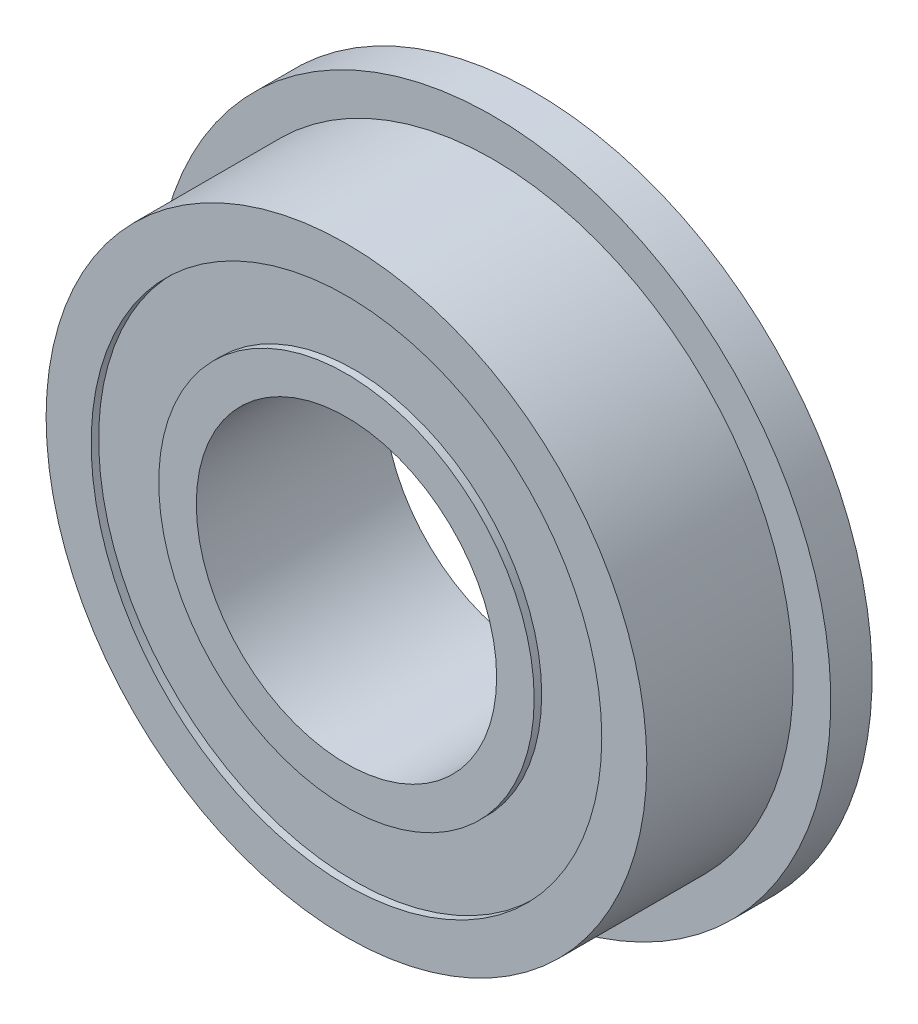
ISO-10303-21;
HEADER;
FILE_DESCRIPTION(('STEP AP214'),'2;1');
FILE_NAME('part.step','',(''),(''),'','','');
FILE_SCHEMA(('AUTOMOTIVE_DESIGN { 1 0 10303 214 1 1 1 1 }'));
ENDSEC;
DATA;
#1=APPLICATION_CONTEXT('core data for automotive mechanical design processes');
#2=APPLICATION_PROTOCOL_DEFINITION('international standard','automotive_design',2000,#1);
#3=PRODUCT_CONTEXT('',#1,'mechanical');
#4=PRODUCT('Part','Part','',(#3));
#5=PRODUCT_RELATED_PRODUCT_CATEGORY('part','',(#4));
#6=PRODUCT_DEFINITION_FORMATION('','',#4);
#7=PRODUCT_DEFINITION_CONTEXT('part definition',#1,'design');
#8=PRODUCT_DEFINITION('design','',#6,#7);
#9=PRODUCT_DEFINITION_SHAPE('','',#8);
#10=(LENGTH_UNIT() NAMED_UNIT(*) SI_UNIT(.MILLI.,.METRE.));
#11=(NAMED_UNIT(*) PLANE_ANGLE_UNIT() SI_UNIT($,.RADIAN.));
#12=(NAMED_UNIT(*) SI_UNIT($,.STERADIAN.) SOLID_ANGLE_UNIT());
#13=UNCERTAINTY_MEASURE_WITH_UNIT(LENGTH_MEASURE(1.E-05),#10,'distance_accuracy_value','');
#14=(GEOMETRIC_REPRESENTATION_CONTEXT(3) GLOBAL_UNCERTAINTY_ASSIGNED_CONTEXT((#13)) GLOBAL_UNIT_ASSIGNED_CONTEXT((#10,
#11,#12)) REPRESENTATION_CONTEXT('',''));
#15=CARTESIAN_POINT('',(0.,0.,0.));
#16=DIRECTION('',(0.,0.,1.));
#17=DIRECTION('',(1.,0.,0.));
#18=AXIS2_PLACEMENT_3D('',#15,#16,#17);
#19=CARTESIAN_POINT('',(0.,0.,-2.5));
#20=DIRECTION('',(0.,0.,1.));
#21=DIRECTION('',(1.,0.,0.));
#22=AXIS2_PLACEMENT_3D('',#19,#20,#21);
#23=PLANE('',#22);
#24=CARTESIAN_POINT('',(0.,0.,-2.5));
#25=DIRECTION('',(0.,0.,1.));
#26=DIRECTION('',(1.,0.,0.));
#27=AXIS2_PLACEMENT_3D('',#24,#25,#26);
#28=CIRCLE('',#27,4.);
#29=CARTESIAN_POINT('',(4.,0.,-2.5));
#30=VERTEX_POINT('',#29);
#31=EDGE_CURVE('E52',#30,#30,#28,.T.);
#32=ORIENTED_EDGE('',*,*,#31,.T.);
#33=EDGE_LOOP('',(#32));
#34=FACE_BOUND('',#33,.T.);
#35=CARTESIAN_POINT('',(0.,0.,-2.5));
#36=DIRECTION('',(0.,0.,1.));
#37=DIRECTION('',(1.,0.,0.));
#38=AXIS2_PLACEMENT_3D('',#35,#36,#37);
#39=CIRCLE('',#38,5.);
#40=CARTESIAN_POINT('',(5.,0.,-2.5));
#41=VERTEX_POINT('',#40);
#42=EDGE_CURVE('E78',#41,#41,#39,.T.);
#43=ORIENTED_EDGE('',*,*,#42,.F.);
#44=EDGE_LOOP('',(#43));
#45=FACE_BOUND('',#44,.T.);
#46=ADVANCED_FACE('F33',(#34,#45),#23,.F.);
#47=CARTESIAN_POINT('',(0.,0.,2.5));
#48=DIRECTION('',(0.,0.,1.));
#49=DIRECTION('',(1.,0.,0.));
#50=AXIS2_PLACEMENT_3D('',#47,#48,#49);
#51=PLANE('',#50);
#52=CARTESIAN_POINT('',(0.,0.,2.5));
#53=DIRECTION('',(0.,0.,1.));
#54=DIRECTION('',(1.,0.,0.));
#55=AXIS2_PLACEMENT_3D('',#52,#53,#54);
#56=CIRCLE('',#55,4.);
#57=CARTESIAN_POINT('',(4.,0.,2.5));
#58=VERTEX_POINT('',#57);
#59=EDGE_CURVE('E54',#58,#58,#56,.T.);
#60=ORIENTED_EDGE('',*,*,#59,.F.);
#61=EDGE_LOOP('',(#60));
#62=FACE_BOUND('',#61,.T.);
#63=CARTESIAN_POINT('',(0.,0.,2.5));
#64=DIRECTION('',(0.,0.,1.));
#65=DIRECTION('',(1.,0.,0.));
#66=AXIS2_PLACEMENT_3D('',#63,#64,#65);
#67=CIRCLE('',#66,5.);
#68=CARTESIAN_POINT('',(5.,0.,2.5));
#69=VERTEX_POINT('',#68);
#70=EDGE_CURVE('E66',#69,#69,#67,.T.);
#71=ORIENTED_EDGE('',*,*,#70,.T.);
#72=EDGE_LOOP('',(#71));
#73=FACE_BOUND('',#72,.T.);
#74=ADVANCED_FACE('F94',(#62,#73),#51,.T.);
#75=CARTESIAN_POINT('',(0.,0.,2.5));
#76=DIRECTION('',(0.,0.,-1.));
#77=DIRECTION('',(-1.,0.,0.));
#78=AXIS2_PLACEMENT_3D('',#75,#76,#77);
#79=CYLINDRICAL_SURFACE('',#78,8.);
#80=CARTESIAN_POINT('',(0.,0.,2.5));
#81=DIRECTION('',(0.,0.,1.));
#82=DIRECTION('',(1.,0.,0.));
#83=AXIS2_PLACEMENT_3D('',#80,#81,#82);
#84=CIRCLE('',#83,8.);
#85=CARTESIAN_POINT('',(8.,0.,2.5));
#86=VERTEX_POINT('',#85);
#87=EDGE_CURVE('E40',#86,#86,#84,.T.);
#88=ORIENTED_EDGE('',*,*,#87,.F.);
#89=EDGE_LOOP('',(#88));
#90=FACE_BOUND('',#89,.T.);
#91=CARTESIAN_POINT('',(0.,0.,-1.4));
#92=DIRECTION('',(0.,0.,-1.));
#93=DIRECTION('',(-1.,0.,0.));
#94=AXIS2_PLACEMENT_3D('',#91,#92,#93);
#95=CIRCLE('',#94,8.);
#96=CARTESIAN_POINT('',(-8.,0.,-1.4));
#97=VERTEX_POINT('',#96);
#98=EDGE_CURVE('E10',#97,#97,#95,.T.);
#99=ORIENTED_EDGE('',*,*,#98,.F.);
#100=EDGE_LOOP('',(#99));
#101=FACE_BOUND('',#100,.T.);
#102=ADVANCED_FACE('F35',(#90,#101),#79,.T.);
#103=CARTESIAN_POINT('',(0.,0.,2.5));
#104=DIRECTION('',(0.,0.,1.));
#105=DIRECTION('',(1.,0.,0.));
#106=AXIS2_PLACEMENT_3D('',#103,#104,#105);
#107=CIRCLE('',#106,6.8);
#108=CARTESIAN_POINT('',(6.8,0.,2.5));
#109=VERTEX_POINT('',#108);
#110=EDGE_CURVE('E60',#109,#109,#107,.T.);
#111=ORIENTED_EDGE('',*,*,#110,.F.);
#112=EDGE_LOOP('',(#111));
#113=FACE_BOUND('',#112,.T.);
#114=ORIENTED_EDGE('',*,*,#87,.T.);
#115=EDGE_LOOP('',(#114));
#116=FACE_BOUND('',#115,.T.);
#117=ADVANCED_FACE('F102',(#113,#116),#51,.T.);
#118=CARTESIAN_POINT('',(0.,0.,-1.4));
#119=DIRECTION('',(0.,0.,-1.));
#120=DIRECTION('',(-1.,0.,0.));
#121=AXIS2_PLACEMENT_3D('',#118,#119,#120);
#122=CYLINDRICAL_SURFACE('',#121,9.);
#123=CARTESIAN_POINT('',(0.,0.,-1.4));
#124=DIRECTION('',(0.,0.,-1.));
#125=DIRECTION('',(-1.,0.,0.));
#126=AXIS2_PLACEMENT_3D('',#123,#124,#125);
#127=CIRCLE('',#126,9.);
#128=CARTESIAN_POINT('',(-9.,0.,-1.4));
#129=VERTEX_POINT('',#128);
#130=EDGE_CURVE('E44',#129,#129,#127,.T.);
#131=ORIENTED_EDGE('',*,*,#130,.T.);
#132=EDGE_LOOP('',(#131));
#133=FACE_BOUND('',#132,.T.);
#134=CARTESIAN_POINT('',(0.,0.,-2.5));
#135=DIRECTION('',(0.,0.,-1.));
#136=DIRECTION('',(-1.,0.,0.));
#137=AXIS2_PLACEMENT_3D('',#134,#135,#136);
#138=CIRCLE('',#137,9.);
#139=CARTESIAN_POINT('',(-9.,0.,-2.5));
#140=VERTEX_POINT('',#139);
#141=EDGE_CURVE('E48',#140,#140,#138,.T.);
#142=ORIENTED_EDGE('',*,*,#141,.F.);
#143=EDGE_LOOP('',(#142));
#144=FACE_BOUND('',#143,.T.);
#145=ADVANCED_FACE('F114',(#133,#144),#122,.T.);
#146=CARTESIAN_POINT('',(0.,0.,-1.4));
#147=DIRECTION('',(0.,0.,-1.));
#148=DIRECTION('',(-1.,0.,0.));
#149=AXIS2_PLACEMENT_3D('',#146,#147,#148);
#150=PLANE('',#149);
#151=ORIENTED_EDGE('',*,*,#98,.T.);
#152=EDGE_LOOP('',(#151));
#153=FACE_BOUND('',#152,.T.);
#154=ORIENTED_EDGE('',*,*,#130,.F.);
#155=EDGE_LOOP('',(#154));
#156=FACE_BOUND('',#155,.T.);
#157=ADVANCED_FACE('F105',(#153,#156),#150,.F.);
#158=CARTESIAN_POINT('',(0.,0.,-2.5));
#159=DIRECTION('',(0.,0.,1.));
#160=DIRECTION('',(1.,0.,0.));
#161=AXIS2_PLACEMENT_3D('',#158,#159,#160);
#162=CIRCLE('',#161,6.8);
#163=CARTESIAN_POINT('',(6.8,0.,-2.5));
#164=VERTEX_POINT('',#163);
#165=EDGE_CURVE('E72',#164,#164,#162,.T.);
#166=ORIENTED_EDGE('',*,*,#165,.T.);
#167=EDGE_LOOP('',(#166));
#168=FACE_BOUND('',#167,.T.);
#169=ORIENTED_EDGE('',*,*,#141,.T.);
#170=EDGE_LOOP('',(#169));
#171=FACE_BOUND('',#170,.T.);
#172=ADVANCED_FACE('F96',(#168,#171),#23,.F.);
#173=CARTESIAN_POINT('',(0.,0.,-2.5));
#174=DIRECTION('',(0.,0.,1.));
#175=DIRECTION('',(1.,0.,0.));
#176=AXIS2_PLACEMENT_3D('',#173,#174,#175);
#177=CYLINDRICAL_SURFACE('',#176,4.);
#178=ORIENTED_EDGE('',*,*,#31,.F.);
#179=EDGE_LOOP('',(#178));
#180=FACE_BOUND('',#179,.T.);
#181=ORIENTED_EDGE('',*,*,#59,.T.);
#182=EDGE_LOOP('',(#181));
#183=FACE_BOUND('',#182,.T.);
#184=ADVANCED_FACE('F104',(#180,#183),#177,.F.);
#185=CARTESIAN_POINT('',(0.,0.,2.3));
#186=DIRECTION('',(0.,0.,1.));
#187=DIRECTION('',(1.,0.,0.));
#188=AXIS2_PLACEMENT_3D('',#185,#186,#187);
#189=CYLINDRICAL_SURFACE('',#188,6.8);
#190=CARTESIAN_POINT('',(0.,0.,2.3));
#191=DIRECTION('',(0.,0.,1.));
#192=DIRECTION('',(1.,0.,0.));
#193=AXIS2_PLACEMENT_3D('',#190,#191,#192);
#194=CIRCLE('',#193,6.8);
#195=CARTESIAN_POINT('',(6.8,0.,2.3));
#196=VERTEX_POINT('',#195);
#197=EDGE_CURVE('E57',#196,#196,#194,.T.);
#198=ORIENTED_EDGE('',*,*,#197,.F.);
#199=EDGE_LOOP('',(#198));
#200=FACE_BOUND('',#199,.T.);
#201=ORIENTED_EDGE('',*,*,#110,.T.);
#202=EDGE_LOOP('',(#201));
#203=FACE_BOUND('',#202,.T.);
#204=ADVANCED_FACE('F111',(#200,#203),#189,.F.);
#205=CARTESIAN_POINT('',(0.,0.,2.3));
#206=DIRECTION('',(0.,0.,1.));
#207=DIRECTION('',(1.,0.,0.));
#208=AXIS2_PLACEMENT_3D('',#205,#206,#207);
#209=PLANE('',#208);
#210=CARTESIAN_POINT('',(0.,0.,2.3));
#211=DIRECTION('',(0.,0.,1.));
#212=DIRECTION('',(1.,0.,0.));
#213=AXIS2_PLACEMENT_3D('',#210,#211,#212);
#214=CIRCLE('',#213,5.);
#215=CARTESIAN_POINT('',(5.,0.,2.3));
#216=VERTEX_POINT('',#215);
#217=EDGE_CURVE('E63',#216,#216,#214,.T.);
#218=ORIENTED_EDGE('',*,*,#217,.F.);
#219=EDGE_LOOP('',(#218));
#220=FACE_BOUND('',#219,.T.);
#221=ORIENTED_EDGE('',*,*,#197,.T.);
#222=EDGE_LOOP('',(#221));
#223=FACE_BOUND('',#222,.T.);
#224=ADVANCED_FACE('F130',(#220,#223),#209,.T.);
#225=CARTESIAN_POINT('',(0.,0.,2.3));
#226=DIRECTION('',(0.,0.,1.));
#227=DIRECTION('',(1.,0.,0.));
#228=AXIS2_PLACEMENT_3D('',#225,#226,#227);
#229=CYLINDRICAL_SURFACE('',#228,5.);
#230=ORIENTED_EDGE('',*,*,#217,.T.);
#231=EDGE_LOOP('',(#230));
#232=FACE_BOUND('',#231,.T.);
#233=ORIENTED_EDGE('',*,*,#70,.F.);
#234=EDGE_LOOP('',(#233));
#235=FACE_BOUND('',#234,.T.);
#236=ADVANCED_FACE('F134',(#232,#235),#229,.T.);
#237=CARTESIAN_POINT('',(0.,0.,-2.3));
#238=DIRECTION('',(0.,0.,-1.));
#239=DIRECTION('',(1.,0.,0.));
#240=AXIS2_PLACEMENT_3D('',#237,#238,#239);
#241=PLANE('',#240);
#242=CARTESIAN_POINT('',(0.,0.,-2.3));
#243=DIRECTION('',(0.,0.,1.));
#244=DIRECTION('',(1.,0.,0.));
#245=AXIS2_PLACEMENT_3D('',#242,#243,#244);
#246=CIRCLE('',#245,6.8);
#247=CARTESIAN_POINT('',(6.8,0.,-2.3));
#248=VERTEX_POINT('',#247);
#249=EDGE_CURVE('E69',#248,#248,#246,.T.);
#250=ORIENTED_EDGE('',*,*,#249,.F.);
#251=EDGE_LOOP('',(#250));
#252=FACE_BOUND('',#251,.T.);
#253=CARTESIAN_POINT('',(0.,0.,-2.3));
#254=DIRECTION('',(0.,0.,1.));
#255=DIRECTION('',(1.,0.,0.));
#256=AXIS2_PLACEMENT_3D('',#253,#254,#255);
#257=CIRCLE('',#256,5.);
#258=CARTESIAN_POINT('',(5.,0.,-2.3));
#259=VERTEX_POINT('',#258);
#260=EDGE_CURVE('E75',#259,#259,#257,.T.);
#261=ORIENTED_EDGE('',*,*,#260,.T.);
#262=EDGE_LOOP('',(#261));
#263=FACE_BOUND('',#262,.T.);
#264=ADVANCED_FACE('F84',(#252,#263),#241,.T.);
#265=CARTESIAN_POINT('',(0.,0.,-2.3));
#266=DIRECTION('',(0.,0.,-1.));
#267=DIRECTION('',(-1.,0.,0.));
#268=AXIS2_PLACEMENT_3D('',#265,#266,#267);
#269=CYLINDRICAL_SURFACE('',#268,6.8);
#270=ORIENTED_EDGE('',*,*,#249,.T.);
#271=EDGE_LOOP('',(#270));
#272=FACE_BOUND('',#271,.T.);
#273=ORIENTED_EDGE('',*,*,#165,.F.);
#274=EDGE_LOOP('',(#273));
#275=FACE_BOUND('',#274,.T.);
#276=ADVANCED_FACE('F89',(#272,#275),#269,.F.);
#277=CARTESIAN_POINT('',(0.,0.,-2.3));
#278=DIRECTION('',(0.,0.,-1.));
#279=DIRECTION('',(-1.,0.,0.));
#280=AXIS2_PLACEMENT_3D('',#277,#278,#279);
#281=CYLINDRICAL_SURFACE('',#280,5.);
#282=ORIENTED_EDGE('',*,*,#260,.F.);
#283=EDGE_LOOP('',(#282));
#284=FACE_BOUND('',#283,.T.);
#285=ORIENTED_EDGE('',*,*,#42,.T.);
#286=EDGE_LOOP('',(#285));
#287=FACE_BOUND('',#286,.T.);
#288=ADVANCED_FACE('F86',(#284,#287),#281,.T.);
#289=CLOSED_SHELL('',(#46,#74,#102,#117,#145,#157,#172,#184,#204,#224,#236,#264,#276,#288));
#290=MANIFOLD_SOLID_BREP('B2',#289);
#291=ADVANCED_BREP_SHAPE_REPRESENTATION('',(#18,#290),#14);
#292=SHAPE_DEFINITION_REPRESENTATION(#9,#291);
ENDSEC;
END-ISO-10303-21;
